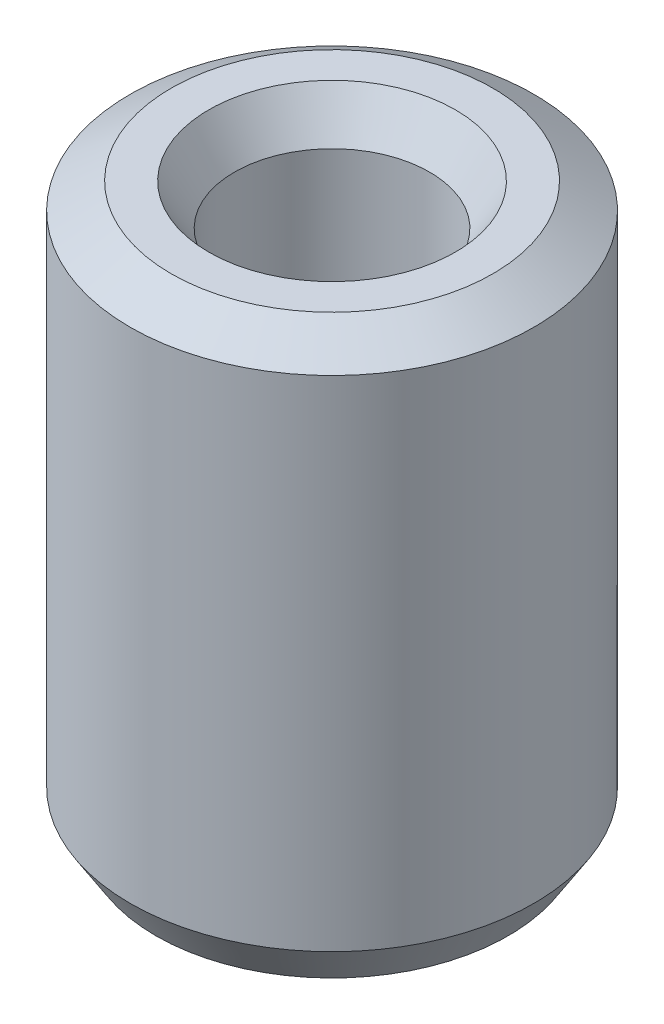
ISO-10303-21;
HEADER;
FILE_DESCRIPTION(('STEP AP214'),'2;1');
FILE_NAME('part.step','',(''),(''),'','','');
FILE_SCHEMA(('AUTOMOTIVE_DESIGN { 1 0 10303 214 1 1 1 1 }'));
ENDSEC;
DATA;
#1=APPLICATION_CONTEXT('core data for automotive mechanical design processes');
#2=APPLICATION_PROTOCOL_DEFINITION('international standard','automotive_design',2000,#1);
#3=PRODUCT_CONTEXT('',#1,'mechanical');
#4=PRODUCT('Part','Part','',(#3));
#5=PRODUCT_RELATED_PRODUCT_CATEGORY('part','',(#4));
#6=PRODUCT_DEFINITION_FORMATION('','',#4);
#7=PRODUCT_DEFINITION_CONTEXT('part definition',#1,'design');
#8=PRODUCT_DEFINITION('design','',#6,#7);
#9=PRODUCT_DEFINITION_SHAPE('','',#8);
#10=(LENGTH_UNIT() NAMED_UNIT(*) SI_UNIT(.MILLI.,.METRE.));
#11=(NAMED_UNIT(*) PLANE_ANGLE_UNIT() SI_UNIT($,.RADIAN.));
#12=(NAMED_UNIT(*) SI_UNIT($,.STERADIAN.) SOLID_ANGLE_UNIT());
#13=UNCERTAINTY_MEASURE_WITH_UNIT(LENGTH_MEASURE(1.E-05),#10,'distance_accuracy_value','');
#14=(GEOMETRIC_REPRESENTATION_CONTEXT(3) GLOBAL_UNCERTAINTY_ASSIGNED_CONTEXT((#13)) GLOBAL_UNIT_ASSIGNED_CONTEXT((#10,
#11,#12)) REPRESENTATION_CONTEXT('',''));
#15=CARTESIAN_POINT('',(0.,0.,0.));
#16=DIRECTION('',(0.,0.,1.));
#17=DIRECTION('',(1.,0.,0.));
#18=AXIS2_PLACEMENT_3D('',#15,#16,#17);
#19=CARTESIAN_POINT('',(0.,14.0148627241275,0.));
#20=DIRECTION('',(0.,-1.,0.));
#21=DIRECTION('',(0.,0.,-1.));
#22=AXIS2_PLACEMENT_3D('',#19,#20,#21);
#23=CYLINDRICAL_SURFACE('',#22,5.);
#24=CARTESIAN_POINT('',(0.,1.01603257680838,0.));
#25=DIRECTION('',(0.,1.,0.));
#26=DIRECTION('',(0.,0.,1.));
#27=AXIS2_PLACEMENT_3D('',#24,#25,#26);
#28=CIRCLE('',#27,5.);
#29=CARTESIAN_POINT('',(0.,1.01603257680838,5.));
#30=VERTEX_POINT('',#29);
#31=EDGE_CURVE('E10',#30,#30,#28,.T.);
#32=ORIENTED_EDGE('',*,*,#31,.T.);
#33=EDGE_LOOP('',(#32));
#34=FACE_BOUND('',#33,.T.);
#35=CARTESIAN_POINT('',(0.,13.3759537694074,0.));
#36=DIRECTION('',(0.,1.,0.));
#37=DIRECTION('',(0.,0.,1.));
#38=AXIS2_PLACEMENT_3D('',#35,#36,#37);
#39=CIRCLE('',#38,5.);
#40=CARTESIAN_POINT('',(0.,13.3759537694074,5.));
#41=VERTEX_POINT('',#40);
#42=EDGE_CURVE('E50',#41,#41,#39,.F.);
#43=ORIENTED_EDGE('',*,*,#42,.T.);
#44=EDGE_LOOP('',(#43));
#45=FACE_BOUND('',#44,.T.);
#46=ADVANCED_FACE('F39',(#34,#45),#23,.T.);
#47=CARTESIAN_POINT('',(0.,14.0148627241275,0.));
#48=DIRECTION('',(0.,1.,0.));
#49=DIRECTION('',(0.,0.,1.));
#50=AXIS2_PLACEMENT_3D('',#47,#48,#49);
#51=PLANE('',#50);
#52=CARTESIAN_POINT('',(0.,14.0148627241275,0.));
#53=DIRECTION('',(0.,1.,0.));
#54=DIRECTION('',(0.,0.,1.));
#55=AXIS2_PLACEMENT_3D('',#52,#53,#54);
#56=CIRCLE('',#55,3.05467625567358);
#57=CARTESIAN_POINT('',(0.,14.0148627241275,3.05467625567358));
#58=VERTEX_POINT('',#57);
#59=EDGE_CURVE('E58',#58,#58,#56,.F.);
#60=ORIENTED_EDGE('',*,*,#59,.T.);
#61=EDGE_LOOP('',(#60));
#62=FACE_BOUND('',#61,.T.);
#63=CARTESIAN_POINT('',(0.,14.0148627241275,0.));
#64=DIRECTION('',(0.,1.,0.));
#65=DIRECTION('',(0.,0.,1.));
#66=AXIS2_PLACEMENT_3D('',#63,#64,#65);
#67=CIRCLE('',#66,3.98396742319163);
#68=CARTESIAN_POINT('',(0.,14.0148627241275,3.98396742319163));
#69=VERTEX_POINT('',#68);
#70=EDGE_CURVE('E61',#69,#69,#67,.T.);
#71=ORIENTED_EDGE('',*,*,#70,.T.);
#72=EDGE_LOOP('',(#71));
#73=FACE_BOUND('',#72,.T.);
#74=ADVANCED_FACE('F88',(#62,#73),#51,.T.);
#75=CARTESIAN_POINT('',(0.,0.,0.));
#76=DIRECTION('',(0.,1.,0.));
#77=DIRECTION('',(0.,0.,1.));
#78=AXIS2_PLACEMENT_3D('',#75,#76,#77);
#79=PLANE('',#78);
#80=CARTESIAN_POINT('',(0.,0.,0.));
#81=DIRECTION('',(0.,1.,0.));
#82=DIRECTION('',(0.,0.,1.));
#83=AXIS2_PLACEMENT_3D('',#80,#81,#82);
#84=CIRCLE('',#83,3.4317998777618);
#85=CARTESIAN_POINT('',(0.,0.,3.4317998777618));
#86=VERTEX_POINT('',#85);
#87=EDGE_CURVE('E51',#86,#86,#84,.T.);
#88=ORIENTED_EDGE('',*,*,#87,.T.);
#89=EDGE_LOOP('',(#88));
#90=FACE_BOUND('',#89,.T.);
#91=CARTESIAN_POINT('',(0.,0.,0.));
#92=DIRECTION('',(0.,1.,0.));
#93=DIRECTION('',(0.,0.,1.));
#94=AXIS2_PLACEMENT_3D('',#91,#92,#93);
#95=CIRCLE('',#94,4.36109104527983);
#96=CARTESIAN_POINT('',(0.,0.,4.36109104527983));
#97=VERTEX_POINT('',#96);
#98=EDGE_CURVE('E54',#97,#97,#95,.F.);
#99=ORIENTED_EDGE('',*,*,#98,.T.);
#100=EDGE_LOOP('',(#99));
#101=FACE_BOUND('',#100,.T.);
#102=ADVANCED_FACE('F83',(#90,#101),#79,.F.);
#103=CARTESIAN_POINT('',(0.,14.0148627241275,0.));
#104=DIRECTION('',(0.,-1.,0.));
#105=DIRECTION('',(0.,0.,-1.));
#106=AXIS2_PLACEMENT_3D('',#103,#104,#105);
#107=CYLINDRICAL_SURFACE('',#106,2.41576730095343);
#108=CARTESIAN_POINT('',(0.,12.9988301473192,0.));
#109=DIRECTION('',(0.,1.,0.));
#110=DIRECTION('',(0.,0.,1.));
#111=AXIS2_PLACEMENT_3D('',#108,#109,#110);
#112=CIRCLE('',#111,2.41576730095343);
#113=CARTESIAN_POINT('',(0.,12.9988301473192,2.41576730095343));
#114=VERTEX_POINT('',#113);
#115=EDGE_CURVE('E67',#114,#114,#112,.T.);
#116=ORIENTED_EDGE('',*,*,#115,.T.);
#117=EDGE_LOOP('',(#116));
#118=FACE_BOUND('',#117,.T.);
#119=CARTESIAN_POINT('',(0.,0.638908954720163,0.));
#120=DIRECTION('',(0.,1.,0.));
#121=DIRECTION('',(0.,0.,1.));
#122=AXIS2_PLACEMENT_3D('',#119,#120,#121);
#123=CIRCLE('',#122,2.41576730095343);
#124=CARTESIAN_POINT('',(0.,0.638908954720163,2.41576730095343));
#125=VERTEX_POINT('',#124);
#126=EDGE_CURVE('E69',#125,#125,#123,.F.);
#127=ORIENTED_EDGE('',*,*,#126,.T.);
#128=EDGE_LOOP('',(#127));
#129=FACE_BOUND('',#128,.T.);
#130=ADVANCED_FACE('F71',(#118,#129),#107,.F.);
#131=CARTESIAN_POINT('',(0.,12.9988301473192,0.));
#132=DIRECTION('',(0.,1.,0.));
#133=DIRECTION('',(0.,0.,1.));
#134=AXIS2_PLACEMENT_3D('',#131,#132,#133);
#135=CONICAL_SURFACE('',#134,2.41576730095343,0.561346750663649);
#136=ORIENTED_EDGE('',*,*,#59,.F.);
#137=EDGE_LOOP('',(#136));
#138=FACE_BOUND('',#137,.T.);
#139=ORIENTED_EDGE('',*,*,#115,.F.);
#140=EDGE_LOOP('',(#139));
#141=FACE_BOUND('',#140,.T.);
#142=ADVANCED_FACE('F77',(#138,#141),#135,.F.);
#143=CARTESIAN_POINT('',(0.,0.,0.));
#144=DIRECTION('',(0.,-1.,0.));
#145=DIRECTION('',(0.,0.,-1.));
#146=AXIS2_PLACEMENT_3D('',#143,#144,#145);
#147=CONICAL_SURFACE('',#146,3.4317998777618,1.00944957613125);
#148=ORIENTED_EDGE('',*,*,#126,.F.);
#149=EDGE_LOOP('',(#148));
#150=FACE_BOUND('',#149,.T.);
#151=ORIENTED_EDGE('',*,*,#87,.F.);
#152=EDGE_LOOP('',(#151));
#153=FACE_BOUND('',#152,.T.);
#154=ADVANCED_FACE('F73',(#150,#153),#147,.F.);
#155=CARTESIAN_POINT('',(0.,1.01603257680838,0.));
#156=DIRECTION('',(0.,1.,0.));
#157=DIRECTION('',(0.,0.,1.));
#158=AXIS2_PLACEMENT_3D('',#155,#156,#157);
#159=CONICAL_SURFACE('',#158,5.,0.561346750663649);
#160=ORIENTED_EDGE('',*,*,#98,.F.);
#161=EDGE_LOOP('',(#160));
#162=FACE_BOUND('',#161,.T.);
#163=ORIENTED_EDGE('',*,*,#31,.F.);
#164=EDGE_LOOP('',(#163));
#165=FACE_BOUND('',#164,.T.);
#166=ADVANCED_FACE('F76',(#162,#165),#159,.T.);
#167=CARTESIAN_POINT('',(0.,14.0148627241275,0.));
#168=DIRECTION('',(0.,-1.,0.));
#169=DIRECTION('',(0.,0.,-1.));
#170=AXIS2_PLACEMENT_3D('',#167,#168,#169);
#171=CONICAL_SURFACE('',#170,3.98396742319163,1.00944957613125);
#172=ORIENTED_EDGE('',*,*,#42,.F.);
#173=EDGE_LOOP('',(#172));
#174=FACE_BOUND('',#173,.T.);
#175=ORIENTED_EDGE('',*,*,#70,.F.);
#176=EDGE_LOOP('',(#175));
#177=FACE_BOUND('',#176,.T.);
#178=ADVANCED_FACE('F45',(#174,#177),#171,.T.);
#179=CLOSED_SHELL('',(#46,#74,#102,#130,#142,#154,#166,#178));
#180=MANIFOLD_SOLID_BREP('B2',#179);
#181=ADVANCED_BREP_SHAPE_REPRESENTATION('',(#18,#180),#14);
#182=SHAPE_DEFINITION_REPRESENTATION(#9,#181);
ENDSEC;
END-ISO-10303-21;
